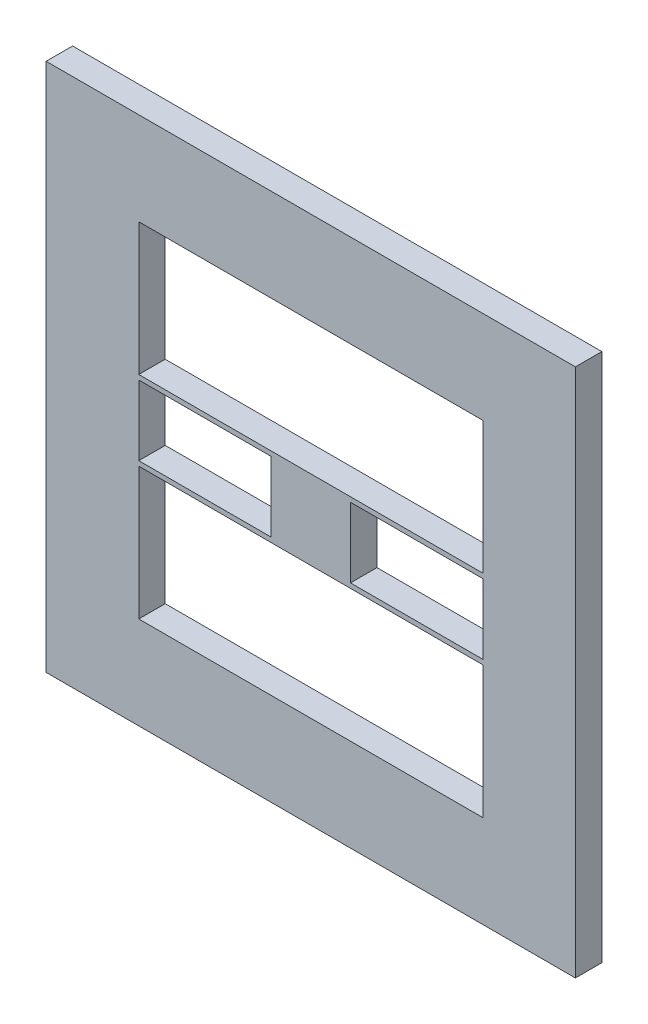
ISO-10303-21;
HEADER;
FILE_DESCRIPTION(('STEP AP214'),'2;1');
FILE_NAME('part.step','',(''),(''),'','','');
FILE_SCHEMA(('AUTOMOTIVE_DESIGN { 1 0 10303 214 1 1 1 1 }'));
ENDSEC;
DATA;
#1=APPLICATION_CONTEXT('core data for automotive mechanical design processes');
#2=APPLICATION_PROTOCOL_DEFINITION('international standard','automotive_design',2000,#1);
#3=PRODUCT_CONTEXT('',#1,'mechanical');
#4=PRODUCT('Part','Part','',(#3));
#5=PRODUCT_RELATED_PRODUCT_CATEGORY('part','',(#4));
#6=PRODUCT_DEFINITION_FORMATION('','',#4);
#7=PRODUCT_DEFINITION_CONTEXT('part definition',#1,'design');
#8=PRODUCT_DEFINITION('design','',#6,#7);
#9=PRODUCT_DEFINITION_SHAPE('','',#8);
#10=(LENGTH_UNIT() NAMED_UNIT(*) SI_UNIT(.MILLI.,.METRE.));
#11=(NAMED_UNIT(*) PLANE_ANGLE_UNIT() SI_UNIT($,.RADIAN.));
#12=(NAMED_UNIT(*) SI_UNIT($,.STERADIAN.) SOLID_ANGLE_UNIT());
#13=UNCERTAINTY_MEASURE_WITH_UNIT(LENGTH_MEASURE(1.E-05),#10,'distance_accuracy_value','');
#14=(GEOMETRIC_REPRESENTATION_CONTEXT(3) GLOBAL_UNCERTAINTY_ASSIGNED_CONTEXT((#13)) GLOBAL_UNIT_ASSIGNED_CONTEXT((#10,
#11,#12)) REPRESENTATION_CONTEXT('',''));
#15=CARTESIAN_POINT('',(0.,0.,0.));
#16=DIRECTION('',(0.,0.,1.));
#17=DIRECTION('',(1.,0.,0.));
#18=AXIS2_PLACEMENT_3D('',#15,#16,#17);
#19=CARTESIAN_POINT('',(-0.075,0.075,0.05));
#20=DIRECTION('',(1.,0.,0.));
#21=DIRECTION('',(0.,1.,0.));
#22=AXIS2_PLACEMENT_3D('',#19,#20,#21);
#23=PLANE('',#22);
#24=DIRECTION('',(0.,-1.,0.));
#25=VECTOR('',#24,1.);
#26=CARTESIAN_POINT('',(-0.075,0.075,0.));
#27=LINE('',#26,#25);
#28=CARTESIAN_POINT('',(-0.075,0.066,0.));
#29=VERTEX_POINT('',#28);
#30=CARTESIAN_POINT('',(-0.075,-0.066,0.));
#31=VERTEX_POINT('',#30);
#32=EDGE_CURVE('E248',#29,#31,#27,.T.);
#33=ORIENTED_EDGE('',*,*,#32,.T.);
#34=DIRECTION('',(0.,0.,1.));
#35=VECTOR('',#34,1.);
#36=CARTESIAN_POINT('',(-0.0749999999999999,-0.066,-0.250161947545985));
#37=LINE('',#36,#35);
#38=CARTESIAN_POINT('',(-0.075,-0.066,0.05));
#39=VERTEX_POINT('',#38);
#40=EDGE_CURVE('E54',#31,#39,#37,.T.);
#41=ORIENTED_EDGE('',*,*,#40,.T.);
#42=DIRECTION('',(0.,-1.,0.));
#43=VECTOR('',#42,1.);
#44=CARTESIAN_POINT('',(-0.075,0.075,0.05));
#45=LINE('',#44,#43);
#46=CARTESIAN_POINT('',(-0.075,0.066,0.05));
#47=VERTEX_POINT('',#46);
#48=EDGE_CURVE('E237',#47,#39,#45,.T.);
#49=ORIENTED_EDGE('',*,*,#48,.F.);
#50=DIRECTION('',(0.,0.,1.));
#51=VECTOR('',#50,1.);
#52=CARTESIAN_POINT('',(-0.075,0.066,-0.250161947545985));
#53=LINE('',#52,#51);
#54=EDGE_CURVE('E268',#29,#47,#53,.T.);
#55=ORIENTED_EDGE('',*,*,#54,.F.);
#56=EDGE_LOOP('',(#33,#41,#49,#55));
#57=FACE_BOUND('',#56,.T.);
#58=ADVANCED_FACE('F33',(#57),#23,.F.);
#59=CARTESIAN_POINT('',(-0.075,-0.075,0.05));
#60=DIRECTION('',(0.,1.,0.));
#61=DIRECTION('',(0.,0.,1.));
#62=AXIS2_PLACEMENT_3D('',#59,#60,#61);
#63=PLANE('',#62);
#64=DIRECTION('',(1.,0.,0.));
#65=VECTOR('',#64,1.);
#66=CARTESIAN_POINT('',(-0.075,-0.075,0.));
#67=LINE('',#66,#65);
#68=CARTESIAN_POINT('',(-0.325,-0.0750000000000003,0.));
#69=VERTEX_POINT('',#68);
#70=CARTESIAN_POINT('',(0.325,-0.0750000000000002,0.));
#71=VERTEX_POINT('',#70);
#72=EDGE_CURVE('E246',#69,#71,#67,.T.);
#73=ORIENTED_EDGE('',*,*,#72,.T.);
#74=DIRECTION('',(0.,0.,1.));
#75=VECTOR('',#74,1.);
#76=CARTESIAN_POINT('',(0.325,-0.0750000000000002,-0.250161947545985));
#77=LINE('',#76,#75);
#78=CARTESIAN_POINT('',(0.325,-0.0750000000000002,0.05));
#79=VERTEX_POINT('',#78);
#80=EDGE_CURVE('E236',#71,#79,#77,.T.);
#81=ORIENTED_EDGE('',*,*,#80,.T.);
#82=DIRECTION('',(1.,0.,0.));
#83=VECTOR('',#82,1.);
#84=CARTESIAN_POINT('',(-0.075,-0.075,0.05));
#85=LINE('',#84,#83);
#86=CARTESIAN_POINT('',(-0.325,-0.0750000000000003,0.05));
#87=VERTEX_POINT('',#86);
#88=EDGE_CURVE('E195',#87,#79,#85,.T.);
#89=ORIENTED_EDGE('',*,*,#88,.F.);
#90=DIRECTION('',(0.,0.,1.));
#91=VECTOR('',#90,1.);
#92=CARTESIAN_POINT('',(-0.325,-0.0750000000000003,-0.250161947545985));
#93=LINE('',#92,#91);
#94=EDGE_CURVE('E232',#69,#87,#93,.T.);
#95=ORIENTED_EDGE('',*,*,#94,.F.);
#96=EDGE_LOOP('',(#73,#81,#89,#95));
#97=FACE_BOUND('',#96,.T.);
#98=ADVANCED_FACE('F235',(#97),#63,.F.);
#99=CARTESIAN_POINT('',(0.075,0.075,0.05));
#100=DIRECTION('',(-1.,0.,0.));
#101=DIRECTION('',(0.,-1.,0.));
#102=AXIS2_PLACEMENT_3D('',#99,#100,#101);
#103=PLANE('',#102);
#104=DIRECTION('',(0.,1.,0.));
#105=VECTOR('',#104,1.);
#106=CARTESIAN_POINT('',(0.075,0.075,0.05));
#107=LINE('',#106,#105);
#108=CARTESIAN_POINT('',(0.075,-0.0659999999999999,0.05));
#109=VERTEX_POINT('',#108);
#110=CARTESIAN_POINT('',(0.075,0.066,0.05));
#111=VERTEX_POINT('',#110);
#112=EDGE_CURVE('E40',#109,#111,#107,.T.);
#113=ORIENTED_EDGE('',*,*,#112,.F.);
#114=DIRECTION('',(0.,0.,1.));
#115=VECTOR('',#114,1.);
#116=CARTESIAN_POINT('',(0.075,-0.066,-0.250161947545985));
#117=LINE('',#116,#115);
#118=CARTESIAN_POINT('',(0.075,-0.066,0.));
#119=VERTEX_POINT('',#118);
#120=EDGE_CURVE('E291',#119,#109,#117,.T.);
#121=ORIENTED_EDGE('',*,*,#120,.F.);
#122=DIRECTION('',(0.,1.,0.));
#123=VECTOR('',#122,1.);
#124=CARTESIAN_POINT('',(0.075,0.075,0.));
#125=LINE('',#124,#123);
#126=CARTESIAN_POINT('',(0.075,0.066,0.));
#127=VERTEX_POINT('',#126);
#128=EDGE_CURVE('E244',#119,#127,#125,.T.);
#129=ORIENTED_EDGE('',*,*,#128,.T.);
#130=DIRECTION('',(0.,0.,1.));
#131=VECTOR('',#130,1.);
#132=CARTESIAN_POINT('',(0.075,0.066,-0.250161947545985));
#133=LINE('',#132,#131);
#134=EDGE_CURVE('E253',#127,#111,#133,.T.);
#135=ORIENTED_EDGE('',*,*,#134,.T.);
#136=EDGE_LOOP('',(#113,#121,#129,#135));
#137=FACE_BOUND('',#136,.T.);
#138=ADVANCED_FACE('F376',(#137),#103,.F.);
#139=CARTESIAN_POINT('',(-0.075,0.075,0.05));
#140=DIRECTION('',(0.,-1.,0.));
#141=DIRECTION('',(0.,0.,-1.));
#142=AXIS2_PLACEMENT_3D('',#139,#140,#141);
#143=PLANE('',#142);
#144=DIRECTION('',(-1.,0.,0.));
#145=VECTOR('',#144,1.);
#146=CARTESIAN_POINT('',(-0.075,0.075,0.));
#147=LINE('',#146,#145);
#148=CARTESIAN_POINT('',(0.325,0.0750000000000004,0.));
#149=VERTEX_POINT('',#148);
#150=CARTESIAN_POINT('',(-0.325,0.0750000000000003,0.));
#151=VERTEX_POINT('',#150);
#152=EDGE_CURVE('E239',#149,#151,#147,.T.);
#153=ORIENTED_EDGE('',*,*,#152,.T.);
#154=DIRECTION('',(0.,0.,1.));
#155=VECTOR('',#154,1.);
#156=CARTESIAN_POINT('',(-0.325,0.0750000000000003,-0.250161947545985));
#157=LINE('',#156,#155);
#158=CARTESIAN_POINT('',(-0.325,0.0750000000000003,0.05));
#159=VERTEX_POINT('',#158);
#160=EDGE_CURVE('E263',#151,#159,#157,.T.);
#161=ORIENTED_EDGE('',*,*,#160,.T.);
#162=DIRECTION('',(-1.,0.,0.));
#163=VECTOR('',#162,1.);
#164=CARTESIAN_POINT('',(-0.075,0.075,0.05));
#165=LINE('',#164,#163);
#166=CARTESIAN_POINT('',(0.325,0.0750000000000004,0.05));
#167=VERTEX_POINT('',#166);
#168=EDGE_CURVE('E11',#167,#159,#165,.T.);
#169=ORIENTED_EDGE('',*,*,#168,.F.);
#170=DIRECTION('',(0.,0.,1.));
#171=VECTOR('',#170,1.);
#172=CARTESIAN_POINT('',(0.325,0.0750000000000004,-0.250161947545985));
#173=LINE('',#172,#171);
#174=EDGE_CURVE('E209',#149,#167,#173,.T.);
#175=ORIENTED_EDGE('',*,*,#174,.F.);
#176=EDGE_LOOP('',(#153,#161,#169,#175));
#177=FACE_BOUND('',#176,.T.);
#178=ADVANCED_FACE('F426',(#177),#143,.F.);
#179=CARTESIAN_POINT('',(-0.075,-0.075,0.05));
#180=DIRECTION('',(0.,0.,1.));
#181=DIRECTION('',(1.,0.,0.));
#182=AXIS2_PLACEMENT_3D('',#179,#180,#181);
#183=PLANE('',#182);
#184=DIRECTION('',(0.,1.,0.));
#185=VECTOR('',#184,1.);
#186=CARTESIAN_POINT('',(0.325,0.325,0.05));
#187=LINE('',#186,#185);
#188=CARTESIAN_POINT('',(0.325,0.325,0.05));
#189=VERTEX_POINT('',#188);
#190=EDGE_CURVE('E189',#167,#189,#187,.T.);
#191=ORIENTED_EDGE('',*,*,#190,.F.);
#192=ORIENTED_EDGE('',*,*,#168,.T.);
#193=DIRECTION('',(0.,-1.,0.));
#194=VECTOR('',#193,1.);
#195=CARTESIAN_POINT('',(-0.325,0.325,0.05));
#196=LINE('',#195,#194);
#197=CARTESIAN_POINT('',(-0.325,0.325,0.05));
#198=VERTEX_POINT('',#197);
#199=EDGE_CURVE('E190',#198,#159,#196,.T.);
#200=ORIENTED_EDGE('',*,*,#199,.F.);
#201=DIRECTION('',(-1.,0.,0.));
#202=VECTOR('',#201,1.);
#203=CARTESIAN_POINT('',(-0.325,0.325,0.05));
#204=LINE('',#203,#202);
#205=EDGE_CURVE('E197',#189,#198,#204,.T.);
#206=ORIENTED_EDGE('',*,*,#205,.F.);
#207=EDGE_LOOP('',(#191,#192,#200,#206));
#208=FACE_BOUND('',#207,.T.);
#209=CARTESIAN_POINT('',(-0.325,0.0659999999999999,0.05));
#210=VERTEX_POINT('',#209);
#211=CARTESIAN_POINT('',(-0.325,-0.0659999999999999,0.05));
#212=VERTEX_POINT('',#211);
#213=EDGE_CURVE('E225',#210,#212,#196,.T.);
#214=ORIENTED_EDGE('',*,*,#213,.F.);
#215=DIRECTION('',(1.,0.,0.));
#216=VECTOR('',#215,1.);
#217=CARTESIAN_POINT('',(-0.075,0.066,0.05));
#218=LINE('',#217,#216);
#219=EDGE_CURVE('E266',#210,#47,#218,.T.);
#220=ORIENTED_EDGE('',*,*,#219,.T.);
#221=ORIENTED_EDGE('',*,*,#48,.T.);
#222=DIRECTION('',(-1.,0.,0.));
#223=VECTOR('',#222,1.);
#224=CARTESIAN_POINT('',(-0.0749999999999999,-0.066,0.05));
#225=LINE('',#224,#223);
#226=EDGE_CURVE('E280',#39,#212,#225,.T.);
#227=ORIENTED_EDGE('',*,*,#226,.T.);
#228=EDGE_LOOP('',(#214,#220,#221,#227));
#229=FACE_BOUND('',#228,.T.);
#230=CARTESIAN_POINT('',(-0.325,-0.325,0.05));
#231=VERTEX_POINT('',#230);
#232=EDGE_CURVE('E227',#87,#231,#196,.T.);
#233=ORIENTED_EDGE('',*,*,#232,.F.);
#234=ORIENTED_EDGE('',*,*,#88,.T.);
#235=CARTESIAN_POINT('',(0.325,-0.325,0.05));
#236=VERTEX_POINT('',#235);
#237=EDGE_CURVE('E173',#236,#79,#187,.T.);
#238=ORIENTED_EDGE('',*,*,#237,.F.);
#239=DIRECTION('',(1.,0.,0.));
#240=VECTOR('',#239,1.);
#241=CARTESIAN_POINT('',(-0.325,-0.325,0.05));
#242=LINE('',#241,#240);
#243=EDGE_CURVE('E184',#231,#236,#242,.T.);
#244=ORIENTED_EDGE('',*,*,#243,.F.);
#245=EDGE_LOOP('',(#233,#234,#238,#244));
#246=FACE_BOUND('',#245,.T.);
#247=DIRECTION('',(1.,0.,0.));
#248=VECTOR('',#247,1.);
#249=CARTESIAN_POINT('',(0.075,0.066,0.05));
#250=LINE('',#249,#248);
#251=CARTESIAN_POINT('',(0.325,0.066,0.05));
#252=VERTEX_POINT('',#251);
#253=EDGE_CURVE('E256',#111,#252,#250,.T.);
#254=ORIENTED_EDGE('',*,*,#253,.T.);
#255=CARTESIAN_POINT('',(0.325,-0.0659999999999998,0.05));
#256=VERTEX_POINT('',#255);
#257=EDGE_CURVE('E198',#256,#252,#187,.T.);
#258=ORIENTED_EDGE('',*,*,#257,.F.);
#259=DIRECTION('',(-1.,0.,0.));
#260=VECTOR('',#259,1.);
#261=CARTESIAN_POINT('',(0.075,-0.066,0.05));
#262=LINE('',#261,#260);
#263=EDGE_CURVE('E289',#256,#109,#262,.T.);
#264=ORIENTED_EDGE('',*,*,#263,.T.);
#265=ORIENTED_EDGE('',*,*,#112,.T.);
#266=EDGE_LOOP('',(#254,#258,#264,#265));
#267=FACE_BOUND('',#266,.T.);
#268=DIRECTION('',(0.,-1.,0.));
#269=VECTOR('',#268,1.);
#270=CARTESIAN_POINT('',(-0.5,0.5,0.05));
#271=LINE('',#270,#269);
#272=CARTESIAN_POINT('',(-0.5,0.5,0.05));
#273=VERTEX_POINT('',#272);
#274=CARTESIAN_POINT('',(-0.5,-0.5,0.05));
#275=VERTEX_POINT('',#274);
#276=EDGE_CURVE('E318',#273,#275,#271,.T.);
#277=ORIENTED_EDGE('',*,*,#276,.T.);
#278=DIRECTION('',(1.,0.,0.));
#279=VECTOR('',#278,1.);
#280=CARTESIAN_POINT('',(-0.5,-0.5,0.05));
#281=LINE('',#280,#279);
#282=CARTESIAN_POINT('',(0.5,-0.5,0.05));
#283=VERTEX_POINT('',#282);
#284=EDGE_CURVE('E315',#275,#283,#281,.T.);
#285=ORIENTED_EDGE('',*,*,#284,.T.);
#286=DIRECTION('',(0.,1.,0.));
#287=VECTOR('',#286,1.);
#288=CARTESIAN_POINT('',(0.5,0.5,0.05));
#289=LINE('',#288,#287);
#290=CARTESIAN_POINT('',(0.5,0.5,0.05));
#291=VERTEX_POINT('',#290);
#292=EDGE_CURVE('E312',#283,#291,#289,.T.);
#293=ORIENTED_EDGE('',*,*,#292,.T.);
#294=DIRECTION('',(-1.,0.,0.));
#295=VECTOR('',#294,1.);
#296=CARTESIAN_POINT('',(-0.5,0.5,0.05));
#297=LINE('',#296,#295);
#298=EDGE_CURVE('E305',#291,#273,#297,.T.);
#299=ORIENTED_EDGE('',*,*,#298,.T.);
#300=EDGE_LOOP('',(#277,#285,#293,#299));
#301=FACE_BOUND('',#300,.T.);
#302=ADVANCED_FACE('F192',(#208,#229,#246,#267,#301),#183,.T.);
#303=CARTESIAN_POINT('',(-0.075,-0.075,0.));
#304=DIRECTION('',(0.,0.,1.));
#305=DIRECTION('',(1.,0.,0.));
#306=AXIS2_PLACEMENT_3D('',#303,#304,#305);
#307=PLANE('',#306);
#308=DIRECTION('',(0.,-1.,0.));
#309=VECTOR('',#308,1.);
#310=CARTESIAN_POINT('',(0.325,0.325,0.));
#311=LINE('',#310,#309);
#312=CARTESIAN_POINT('',(0.325,0.066,0.));
#313=VERTEX_POINT('',#312);
#314=CARTESIAN_POINT('',(0.325,-0.0659999999999998,0.));
#315=VERTEX_POINT('',#314);
#316=EDGE_CURVE('E334',#313,#315,#311,.T.);
#317=ORIENTED_EDGE('',*,*,#316,.F.);
#318=DIRECTION('',(-1.,0.,0.));
#319=VECTOR('',#318,1.);
#320=CARTESIAN_POINT('',(0.075,0.066,0.));
#321=LINE('',#320,#319);
#322=EDGE_CURVE('E250',#313,#127,#321,.T.);
#323=ORIENTED_EDGE('',*,*,#322,.T.);
#324=ORIENTED_EDGE('',*,*,#128,.F.);
#325=DIRECTION('',(1.,0.,0.));
#326=VECTOR('',#325,1.);
#327=CARTESIAN_POINT('',(0.075,-0.066,0.));
#328=LINE('',#327,#326);
#329=EDGE_CURVE('E286',#119,#315,#328,.T.);
#330=ORIENTED_EDGE('',*,*,#329,.T.);
#331=EDGE_LOOP('',(#317,#323,#324,#330));
#332=FACE_BOUND('',#331,.T.);
#333=DIRECTION('',(0.,1.,0.));
#334=VECTOR('',#333,1.);
#335=CARTESIAN_POINT('',(-0.325,0.325,0.));
#336=LINE('',#335,#334);
#337=CARTESIAN_POINT('',(-0.325,0.325,0.));
#338=VERTEX_POINT('',#337);
#339=EDGE_CURVE('E323',#151,#338,#336,.T.);
#340=ORIENTED_EDGE('',*,*,#339,.F.);
#341=ORIENTED_EDGE('',*,*,#152,.F.);
#342=CARTESIAN_POINT('',(0.325,0.325,0.));
#343=VERTEX_POINT('',#342);
#344=EDGE_CURVE('E332',#343,#149,#311,.T.);
#345=ORIENTED_EDGE('',*,*,#344,.F.);
#346=DIRECTION('',(1.,0.,0.));
#347=VECTOR('',#346,1.);
#348=CARTESIAN_POINT('',(-0.325,0.325,0.));
#349=LINE('',#348,#347);
#350=EDGE_CURVE('E218',#338,#343,#349,.T.);
#351=ORIENTED_EDGE('',*,*,#350,.F.);
#352=EDGE_LOOP('',(#340,#341,#345,#351));
#353=FACE_BOUND('',#352,.T.);
#354=CARTESIAN_POINT('',(-0.325,-0.066,0.));
#355=VERTEX_POINT('',#354);
#356=CARTESIAN_POINT('',(-0.325,0.0659999999999999,0.));
#357=VERTEX_POINT('',#356);
#358=EDGE_CURVE('E326',#355,#357,#336,.T.);
#359=ORIENTED_EDGE('',*,*,#358,.F.);
#360=DIRECTION('',(1.,0.,0.));
#361=VECTOR('',#360,1.);
#362=CARTESIAN_POINT('',(-0.0749999999999999,-0.066,0.));
#363=LINE('',#362,#361);
#364=EDGE_CURVE('E273',#355,#31,#363,.T.);
#365=ORIENTED_EDGE('',*,*,#364,.T.);
#366=ORIENTED_EDGE('',*,*,#32,.F.);
#367=DIRECTION('',(-1.,0.,0.));
#368=VECTOR('',#367,1.);
#369=CARTESIAN_POINT('',(-0.075,0.066,0.));
#370=LINE('',#369,#368);
#371=EDGE_CURVE('E262',#29,#357,#370,.T.);
#372=ORIENTED_EDGE('',*,*,#371,.T.);
#373=EDGE_LOOP('',(#359,#365,#366,#372));
#374=FACE_BOUND('',#373,.T.);
#375=ORIENTED_EDGE('',*,*,#72,.F.);
#376=CARTESIAN_POINT('',(-0.325,-0.325,0.));
#377=VERTEX_POINT('',#376);
#378=EDGE_CURVE('E329',#377,#69,#336,.T.);
#379=ORIENTED_EDGE('',*,*,#378,.F.);
#380=DIRECTION('',(-1.,0.,0.));
#381=VECTOR('',#380,1.);
#382=CARTESIAN_POINT('',(-0.325,-0.325,0.));
#383=LINE('',#382,#381);
#384=CARTESIAN_POINT('',(0.325,-0.325,0.));
#385=VERTEX_POINT('',#384);
#386=EDGE_CURVE('E298',#385,#377,#383,.T.);
#387=ORIENTED_EDGE('',*,*,#386,.F.);
#388=EDGE_CURVE('E175',#71,#385,#311,.T.);
#389=ORIENTED_EDGE('',*,*,#388,.F.);
#390=EDGE_LOOP('',(#375,#379,#387,#389));
#391=FACE_BOUND('',#390,.T.);
#392=DIRECTION('',(0.,1.,0.));
#393=VECTOR('',#392,1.);
#394=CARTESIAN_POINT('',(-0.5,0.5,0.));
#395=LINE('',#394,#393);
#396=CARTESIAN_POINT('',(-0.5,-0.5,0.));
#397=VERTEX_POINT('',#396);
#398=CARTESIAN_POINT('',(-0.5,0.5,0.));
#399=VERTEX_POINT('',#398);
#400=EDGE_CURVE('E327',#397,#399,#395,.T.);
#401=ORIENTED_EDGE('',*,*,#400,.T.);
#402=DIRECTION('',(1.,0.,0.));
#403=VECTOR('',#402,1.);
#404=CARTESIAN_POINT('',(-0.5,0.5,0.));
#405=LINE('',#404,#403);
#406=CARTESIAN_POINT('',(0.5,0.5,0.));
#407=VERTEX_POINT('',#406);
#408=EDGE_CURVE('E339',#399,#407,#405,.T.);
#409=ORIENTED_EDGE('',*,*,#408,.T.);
#410=DIRECTION('',(0.,-1.,0.));
#411=VECTOR('',#410,1.);
#412=CARTESIAN_POINT('',(0.5,0.5,0.));
#413=LINE('',#412,#411);
#414=CARTESIAN_POINT('',(0.5,-0.5,0.));
#415=VERTEX_POINT('',#414);
#416=EDGE_CURVE('E300',#407,#415,#413,.T.);
#417=ORIENTED_EDGE('',*,*,#416,.T.);
#418=DIRECTION('',(-1.,0.,0.));
#419=VECTOR('',#418,1.);
#420=CARTESIAN_POINT('',(-0.5,-0.5,0.));
#421=LINE('',#420,#419);
#422=EDGE_CURVE('E295',#415,#397,#421,.T.);
#423=ORIENTED_EDGE('',*,*,#422,.T.);
#424=EDGE_LOOP('',(#401,#409,#417,#423));
#425=FACE_BOUND('',#424,.T.);
#426=ADVANCED_FACE('F330',(#332,#353,#374,#391,#425),#307,.F.);
#427=CARTESIAN_POINT('',(0.075,0.066,-0.250161947545985));
#428=DIRECTION('',(0.,-1.,0.));
#429=DIRECTION('',(0.,0.,-1.));
#430=AXIS2_PLACEMENT_3D('',#427,#428,#429);
#431=PLANE('',#430);
#432=ORIENTED_EDGE('',*,*,#322,.F.);
#433=DIRECTION('',(0.,0.,1.));
#434=VECTOR('',#433,1.);
#435=CARTESIAN_POINT('',(0.325,0.066,-0.250161947545985));
#436=LINE('',#435,#434);
#437=EDGE_CURVE('E255',#313,#252,#436,.T.);
#438=ORIENTED_EDGE('',*,*,#437,.T.);
#439=ORIENTED_EDGE('',*,*,#253,.F.);
#440=ORIENTED_EDGE('',*,*,#134,.F.);
#441=EDGE_LOOP('',(#432,#438,#439,#440));
#442=FACE_BOUND('',#441,.T.);
#443=ADVANCED_FACE('F422',(#442),#431,.T.);
#444=CARTESIAN_POINT('',(-0.075,0.066,-0.250161947545985));
#445=DIRECTION('',(0.,-1.,0.));
#446=DIRECTION('',(1.,0.,0.));
#447=AXIS2_PLACEMENT_3D('',#444,#445,#446);
#448=PLANE('',#447);
#449=ORIENTED_EDGE('',*,*,#371,.F.);
#450=ORIENTED_EDGE('',*,*,#54,.T.);
#451=ORIENTED_EDGE('',*,*,#219,.F.);
#452=DIRECTION('',(0.,0.,1.));
#453=VECTOR('',#452,1.);
#454=CARTESIAN_POINT('',(-0.325,0.0659999999999999,-0.250161947545985));
#455=LINE('',#454,#453);
#456=EDGE_CURVE('E265',#357,#210,#455,.T.);
#457=ORIENTED_EDGE('',*,*,#456,.F.);
#458=EDGE_LOOP('',(#449,#450,#451,#457));
#459=FACE_BOUND('',#458,.T.);
#460=ADVANCED_FACE('F388',(#459),#448,.T.);
#461=CARTESIAN_POINT('',(-0.0749999999999999,-0.066,-0.250161947545985));
#462=DIRECTION('',(0.,1.,0.));
#463=DIRECTION('',(-1.,0.,0.));
#464=AXIS2_PLACEMENT_3D('',#461,#462,#463);
#465=PLANE('',#464);
#466=ORIENTED_EDGE('',*,*,#364,.F.);
#467=DIRECTION('',(0.,0.,1.));
#468=VECTOR('',#467,1.);
#469=CARTESIAN_POINT('',(-0.325,-0.0659999999999999,-0.250161947545985));
#470=LINE('',#469,#468);
#471=EDGE_CURVE('E279',#355,#212,#470,.T.);
#472=ORIENTED_EDGE('',*,*,#471,.T.);
#473=ORIENTED_EDGE('',*,*,#226,.F.);
#474=ORIENTED_EDGE('',*,*,#40,.F.);
#475=EDGE_LOOP('',(#466,#472,#473,#474));
#476=FACE_BOUND('',#475,.T.);
#477=ADVANCED_FACE('F384',(#476),#465,.T.);
#478=CARTESIAN_POINT('',(0.075,-0.066,-0.250161947545985));
#479=DIRECTION('',(0.,1.,0.));
#480=DIRECTION('',(-1.,0.,0.));
#481=AXIS2_PLACEMENT_3D('',#478,#479,#480);
#482=PLANE('',#481);
#483=ORIENTED_EDGE('',*,*,#329,.F.);
#484=ORIENTED_EDGE('',*,*,#120,.T.);
#485=ORIENTED_EDGE('',*,*,#263,.F.);
#486=DIRECTION('',(0.,0.,1.));
#487=VECTOR('',#486,1.);
#488=CARTESIAN_POINT('',(0.325,-0.0659999999999998,-0.250161947545985));
#489=LINE('',#488,#487);
#490=EDGE_CURVE('E288',#315,#256,#489,.T.);
#491=ORIENTED_EDGE('',*,*,#490,.F.);
#492=EDGE_LOOP('',(#483,#484,#485,#491));
#493=FACE_BOUND('',#492,.T.);
#494=ADVANCED_FACE('F401',(#493),#482,.T.);
#495=CARTESIAN_POINT('',(-0.325,0.325,-1.41421356237309));
#496=DIRECTION('',(-1.,0.,0.));
#497=DIRECTION('',(0.,0.,1.));
#498=AXIS2_PLACEMENT_3D('',#495,#496,#497);
#499=PLANE('',#498);
#500=ORIENTED_EDGE('',*,*,#378,.T.);
#501=ORIENTED_EDGE('',*,*,#94,.T.);
#502=ORIENTED_EDGE('',*,*,#232,.T.);
#503=DIRECTION('',(0.,0.,1.));
#504=VECTOR('',#503,1.);
#505=CARTESIAN_POINT('',(-0.325,-0.325,-1.41421356237309));
#506=LINE('',#505,#504);
#507=EDGE_CURVE('E180',#377,#231,#506,.T.);
#508=ORIENTED_EDGE('',*,*,#507,.F.);
#509=EDGE_LOOP('',(#500,#501,#502,#508));
#510=FACE_BOUND('',#509,.T.);
#511=ADVANCED_FACE('F230',(#510),#499,.F.);
#512=ORIENTED_EDGE('',*,*,#199,.T.);
#513=ORIENTED_EDGE('',*,*,#160,.F.);
#514=ORIENTED_EDGE('',*,*,#339,.T.);
#515=DIRECTION('',(0.,0.,1.));
#516=VECTOR('',#515,1.);
#517=CARTESIAN_POINT('',(-0.325,0.325,-1.41421356237309));
#518=LINE('',#517,#516);
#519=EDGE_CURVE('E219',#338,#198,#518,.T.);
#520=ORIENTED_EDGE('',*,*,#519,.T.);
#521=EDGE_LOOP('',(#512,#513,#514,#520));
#522=FACE_BOUND('',#521,.T.);
#523=ADVANCED_FACE('F322',(#522),#499,.F.);
#524=CARTESIAN_POINT('',(0.325,0.325,-1.41421356237309));
#525=DIRECTION('',(1.,0.,0.));
#526=DIRECTION('',(0.,0.,-1.));
#527=AXIS2_PLACEMENT_3D('',#524,#525,#526);
#528=PLANE('',#527);
#529=ORIENTED_EDGE('',*,*,#237,.T.);
#530=ORIENTED_EDGE('',*,*,#80,.F.);
#531=ORIENTED_EDGE('',*,*,#388,.T.);
#532=DIRECTION('',(0.,0.,1.));
#533=VECTOR('',#532,1.);
#534=CARTESIAN_POINT('',(0.325,-0.325,-1.41421356237309));
#535=LINE('',#534,#533);
#536=EDGE_CURVE('E168',#385,#236,#535,.T.);
#537=ORIENTED_EDGE('',*,*,#536,.T.);
#538=EDGE_LOOP('',(#529,#530,#531,#537));
#539=FACE_BOUND('',#538,.T.);
#540=ADVANCED_FACE('F170',(#539),#528,.F.);
#541=ORIENTED_EDGE('',*,*,#344,.T.);
#542=ORIENTED_EDGE('',*,*,#174,.T.);
#543=ORIENTED_EDGE('',*,*,#190,.T.);
#544=DIRECTION('',(0.,0.,1.));
#545=VECTOR('',#544,1.);
#546=CARTESIAN_POINT('',(0.325,0.325,-1.41421356237309));
#547=LINE('',#546,#545);
#548=EDGE_CURVE('E179',#343,#189,#547,.T.);
#549=ORIENTED_EDGE('',*,*,#548,.F.);
#550=EDGE_LOOP('',(#541,#542,#543,#549));
#551=FACE_BOUND('',#550,.T.);
#552=ADVANCED_FACE('F206',(#551),#528,.F.);
#553=CARTESIAN_POINT('',(-0.5,-0.5,-1.41421356237309));
#554=DIRECTION('',(0.,-1.,0.));
#555=DIRECTION('',(0.,0.,-1.));
#556=AXIS2_PLACEMENT_3D('',#553,#554,#555);
#557=PLANE('',#556);
#558=ORIENTED_EDGE('',*,*,#422,.F.);
#559=DIRECTION('',(0.,0.,1.));
#560=VECTOR('',#559,1.);
#561=CARTESIAN_POINT('',(0.5,-0.5,-1.41421356237309));
#562=LINE('',#561,#560);
#563=EDGE_CURVE('E304',#415,#283,#562,.T.);
#564=ORIENTED_EDGE('',*,*,#563,.T.);
#565=ORIENTED_EDGE('',*,*,#284,.F.);
#566=DIRECTION('',(0.,0.,1.));
#567=VECTOR('',#566,1.);
#568=CARTESIAN_POINT('',(-0.5,-0.5,-1.41421356237309));
#569=LINE('',#568,#567);
#570=EDGE_CURVE('E302',#397,#275,#569,.T.);
#571=ORIENTED_EDGE('',*,*,#570,.F.);
#572=EDGE_LOOP('',(#558,#564,#565,#571));
#573=FACE_BOUND('',#572,.T.);
#574=ADVANCED_FACE('F361',(#573),#557,.T.);
#575=CARTESIAN_POINT('',(0.5,0.5,-1.41421356237309));
#576=DIRECTION('',(1.,0.,0.));
#577=DIRECTION('',(0.,0.,-1.));
#578=AXIS2_PLACEMENT_3D('',#575,#576,#577);
#579=PLANE('',#578);
#580=ORIENTED_EDGE('',*,*,#416,.F.);
#581=DIRECTION('',(0.,0.,1.));
#582=VECTOR('',#581,1.);
#583=CARTESIAN_POINT('',(0.5,0.5,-1.41421356237309));
#584=LINE('',#583,#582);
#585=EDGE_CURVE('E307',#407,#291,#584,.T.);
#586=ORIENTED_EDGE('',*,*,#585,.T.);
#587=ORIENTED_EDGE('',*,*,#292,.F.);
#588=ORIENTED_EDGE('',*,*,#563,.F.);
#589=EDGE_LOOP('',(#580,#586,#587,#588));
#590=FACE_BOUND('',#589,.T.);
#591=ADVANCED_FACE('F359',(#590),#579,.T.);
#592=CARTESIAN_POINT('',(-0.5,0.5,-1.41421356237309));
#593=DIRECTION('',(0.,1.,0.));
#594=DIRECTION('',(0.,0.,1.));
#595=AXIS2_PLACEMENT_3D('',#592,#593,#594);
#596=PLANE('',#595);
#597=ORIENTED_EDGE('',*,*,#408,.F.);
#598=DIRECTION('',(0.,0.,1.));
#599=VECTOR('',#598,1.);
#600=CARTESIAN_POINT('',(-0.5,0.5,-1.41421356237309));
#601=LINE('',#600,#599);
#602=EDGE_CURVE('E301',#399,#273,#601,.T.);
#603=ORIENTED_EDGE('',*,*,#602,.T.);
#604=ORIENTED_EDGE('',*,*,#298,.F.);
#605=ORIENTED_EDGE('',*,*,#585,.F.);
#606=EDGE_LOOP('',(#597,#603,#604,#605));
#607=FACE_BOUND('',#606,.T.);
#608=ADVANCED_FACE('F350',(#607),#596,.T.);
#609=CARTESIAN_POINT('',(-0.5,0.5,-1.41421356237309));
#610=DIRECTION('',(-1.,0.,0.));
#611=DIRECTION('',(0.,0.,1.));
#612=AXIS2_PLACEMENT_3D('',#609,#610,#611);
#613=PLANE('',#612);
#614=ORIENTED_EDGE('',*,*,#400,.F.);
#615=ORIENTED_EDGE('',*,*,#570,.T.);
#616=ORIENTED_EDGE('',*,*,#276,.F.);
#617=ORIENTED_EDGE('',*,*,#602,.F.);
#618=EDGE_LOOP('',(#614,#615,#616,#617));
#619=FACE_BOUND('',#618,.T.);
#620=ADVANCED_FACE('F353',(#619),#613,.T.);
#621=CARTESIAN_POINT('',(-0.325,-0.325,-1.41421356237309));
#622=DIRECTION('',(0.,-1.,0.));
#623=DIRECTION('',(0.,0.,-1.));
#624=AXIS2_PLACEMENT_3D('',#621,#622,#623);
#625=PLANE('',#624);
#626=ORIENTED_EDGE('',*,*,#536,.F.);
#627=ORIENTED_EDGE('',*,*,#386,.T.);
#628=ORIENTED_EDGE('',*,*,#507,.T.);
#629=ORIENTED_EDGE('',*,*,#243,.T.);
#630=EDGE_LOOP('',(#626,#627,#628,#629));
#631=FACE_BOUND('',#630,.T.);
#632=ADVANCED_FACE('F185',(#631),#625,.F.);
#633=ORIENTED_EDGE('',*,*,#437,.F.);
#634=ORIENTED_EDGE('',*,*,#316,.T.);
#635=ORIENTED_EDGE('',*,*,#490,.T.);
#636=ORIENTED_EDGE('',*,*,#257,.T.);
#637=EDGE_LOOP('',(#633,#634,#635,#636));
#638=FACE_BOUND('',#637,.T.);
#639=ADVANCED_FACE('F370',(#638),#528,.F.);
#640=CARTESIAN_POINT('',(-0.325,0.325,-1.41421356237309));
#641=DIRECTION('',(0.,1.,0.));
#642=DIRECTION('',(0.,0.,1.));
#643=AXIS2_PLACEMENT_3D('',#640,#641,#642);
#644=PLANE('',#643);
#645=ORIENTED_EDGE('',*,*,#519,.F.);
#646=ORIENTED_EDGE('',*,*,#350,.T.);
#647=ORIENTED_EDGE('',*,*,#548,.T.);
#648=ORIENTED_EDGE('',*,*,#205,.T.);
#649=EDGE_LOOP('',(#645,#646,#647,#648));
#650=FACE_BOUND('',#649,.T.);
#651=ADVANCED_FACE('F215',(#650),#644,.F.);
#652=ORIENTED_EDGE('',*,*,#456,.T.);
#653=ORIENTED_EDGE('',*,*,#213,.T.);
#654=ORIENTED_EDGE('',*,*,#471,.F.);
#655=ORIENTED_EDGE('',*,*,#358,.T.);
#656=EDGE_LOOP('',(#652,#653,#654,#655));
#657=FACE_BOUND('',#656,.T.);
#658=ADVANCED_FACE('F391',(#657),#499,.F.);
#659=CLOSED_SHELL('',(#58,#98,#138,#178,#302,#426,#443,#460,#477,#494,#511,#523,#540,#552,#574,
#591,#608,#620,#632,#639,#651,#658));
#660=MANIFOLD_SOLID_BREP('B2',#659);
#661=ADVANCED_BREP_SHAPE_REPRESENTATION('',(#18,#660),#14);
#662=SHAPE_DEFINITION_REPRESENTATION(#9,#661);
ENDSEC;
END-ISO-10303-21;
